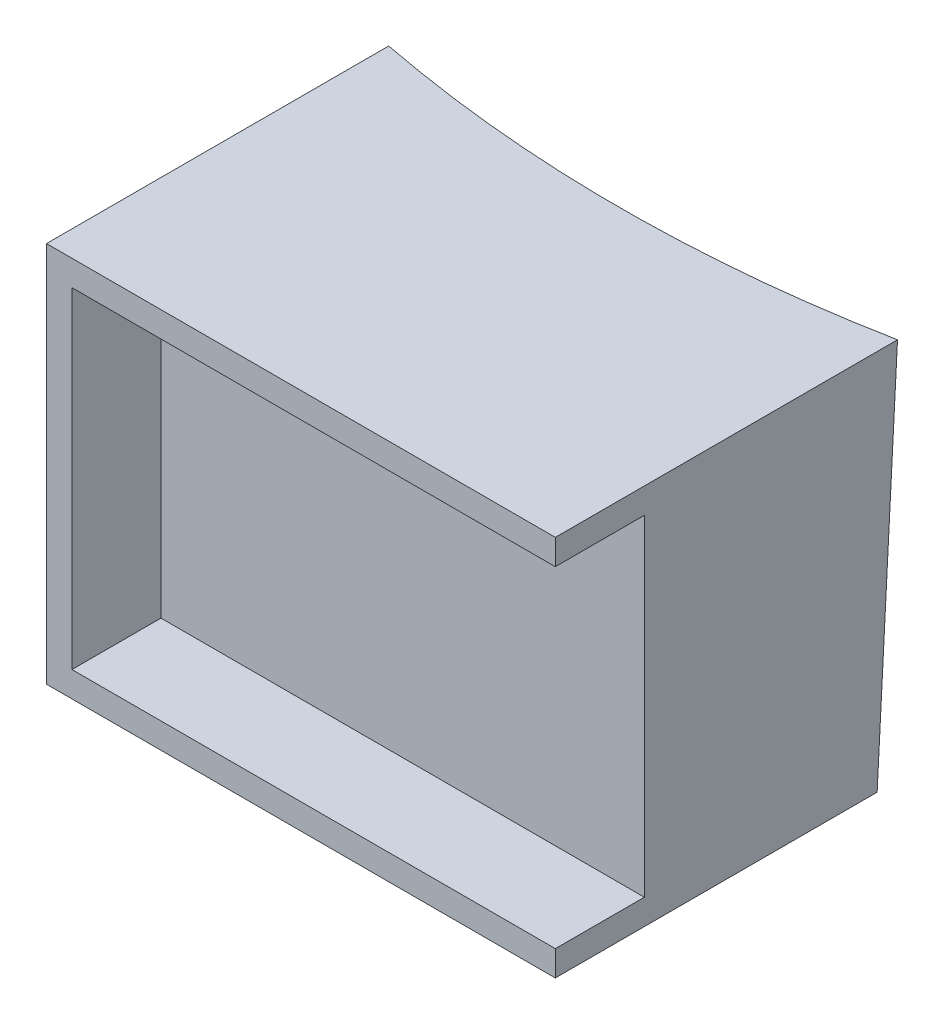
ISO-10303-21;
HEADER;
FILE_DESCRIPTION(('STEP AP214'),'2;1');
FILE_NAME('part.step','',(''),(''),'','','');
FILE_SCHEMA(('AUTOMOTIVE_DESIGN { 1 0 10303 214 1 1 1 1 }'));
ENDSEC;
DATA;
#1=APPLICATION_CONTEXT('core data for automotive mechanical design processes');
#2=APPLICATION_PROTOCOL_DEFINITION('international standard','automotive_design',2000,#1);
#3=PRODUCT_CONTEXT('',#1,'mechanical');
#4=PRODUCT('Part','Part','',(#3));
#5=PRODUCT_RELATED_PRODUCT_CATEGORY('part','',(#4));
#6=PRODUCT_DEFINITION_FORMATION('','',#4);
#7=PRODUCT_DEFINITION_CONTEXT('part definition',#1,'design');
#8=PRODUCT_DEFINITION('design','',#6,#7);
#9=PRODUCT_DEFINITION_SHAPE('','',#8);
#10=(LENGTH_UNIT() NAMED_UNIT(*) SI_UNIT(.MILLI.,.METRE.));
#11=(NAMED_UNIT(*) PLANE_ANGLE_UNIT() SI_UNIT($,.RADIAN.));
#12=(NAMED_UNIT(*) SI_UNIT($,.STERADIAN.) SOLID_ANGLE_UNIT());
#13=UNCERTAINTY_MEASURE_WITH_UNIT(LENGTH_MEASURE(1.E-05),#10,'distance_accuracy_value','');
#14=(GEOMETRIC_REPRESENTATION_CONTEXT(3) GLOBAL_UNCERTAINTY_ASSIGNED_CONTEXT((#13)) GLOBAL_UNIT_ASSIGNED_CONTEXT((#10,
#11,#12)) REPRESENTATION_CONTEXT('',''));
#15=CARTESIAN_POINT('',(0.,0.,0.));
#16=DIRECTION('',(0.,0.,1.));
#17=DIRECTION('',(1.,0.,0.));
#18=AXIS2_PLACEMENT_3D('',#15,#16,#17);
#19=CARTESIAN_POINT('',(0.,30.,130.));
#20=DIRECTION('',(1.,0.,0.));
#21=DIRECTION('',(0.,1.,0.));
#22=AXIS2_PLACEMENT_3D('',#19,#20,#21);
#23=PLANE('',#22);
#24=DIRECTION('',(0.,0.,-1.));
#25=VECTOR('',#24,1.);
#26=CARTESIAN_POINT('',(0.,30.,130.));
#27=LINE('',#26,#25);
#28=CARTESIAN_POINT('',(0.,30.,130.));
#29=VERTEX_POINT('',#28);
#30=CARTESIAN_POINT('',(0.,30.,103.100288572856));
#31=VERTEX_POINT('',#30);
#32=EDGE_CURVE('E255',#29,#31,#27,.T.);
#33=ORIENTED_EDGE('',*,*,#32,.T.);
#34=CARTESIAN_POINT('',(0.,149.336386161893,96.7219380971282));
#35=CARTESIAN_POINT('',(0.,118.095745378578,98.3938104110203));
#36=CARTESIAN_POINT('',(0.,86.8550115185211,100.063942753293));
#37=CARTESIAN_POINT('',(0.,24.3733808564521,103.401153471273));
#38=CARTESIAN_POINT('',(0.,-6.86751594555875,105.068231846998));
#39=CARTESIAN_POINT('',(0.,-51.6464413265629,107.455838469584));
#40=CARTESIAN_POINT('',(0.,-65.184413013588,108.177433956996));
#41=CARTESIAN_POINT('',(0.,-92.2603812844602,109.620158324614));
#42=CARTESIAN_POINT('',(0.,-105.798377868307,110.341287204819));
#43=CARTESIAN_POINT('',(0.,-119.336386161893,111.062196220779));
#44=B_SPLINE_CURVE_WITH_KNOTS('',3,(#34,#35,#36,#37,#38,#39,#40,#41,#42,#43),.UNSPECIFIED.,.F.,
.F.,(4,2,2,2,4),(0.,93.8560340268623,187.712067512617,228.383634934775,269.055202458257),.UNSPECIFIED.);
#45=CARTESIAN_POINT('',(0.,0.,104.701386539078));
#46=VERTEX_POINT('',#45);
#47=EDGE_CURVE('E70',#31,#46,#44,.T.);
#48=ORIENTED_EDGE('',*,*,#47,.T.);
#49=DIRECTION('',(0.,0.,-1.));
#50=VECTOR('',#49,1.);
#51=CARTESIAN_POINT('',(0.,0.,130.));
#52=LINE('',#51,#50);
#53=CARTESIAN_POINT('',(0.,0.,130.));
#54=VERTEX_POINT('',#53);
#55=EDGE_CURVE('E55',#54,#46,#52,.T.);
#56=ORIENTED_EDGE('',*,*,#55,.F.);
#57=DIRECTION('',(0.,-1.,0.));
#58=VECTOR('',#57,1.);
#59=CARTESIAN_POINT('',(0.,30.,130.));
#60=LINE('',#59,#58);
#61=EDGE_CURVE('E241',#29,#54,#60,.T.);
#62=ORIENTED_EDGE('',*,*,#61,.F.);
#63=EDGE_LOOP('',(#33,#48,#56,#62));
#64=FACE_BOUND('',#63,.T.);
#65=ADVANCED_FACE('F46',(#64),#23,.F.);
#66=CARTESIAN_POINT('',(0.,0.,130.));
#67=DIRECTION('',(0.,1.,0.));
#68=DIRECTION('',(0.,0.,1.));
#69=AXIS2_PLACEMENT_3D('',#66,#67,#68);
#70=PLANE('',#69);
#71=ORIENTED_EDGE('',*,*,#55,.T.);
#72=CARTESIAN_POINT('',(20.,0.,0.));
#73=DIRECTION('',(0.,1.,0.));
#74=DIRECTION('',(0.,0.,1.));
#75=AXIS2_PLACEMENT_3D('',#72,#73,#74);
#76=CIRCLE('',#75,106.594466756982);
#77=CARTESIAN_POINT('',(40.,0.,104.701386539078));
#78=VERTEX_POINT('',#77);
#79=EDGE_CURVE('E221',#46,#78,#76,.T.);
#80=ORIENTED_EDGE('',*,*,#79,.T.);
#81=DIRECTION('',(0.,0.,-1.));
#82=VECTOR('',#81,1.);
#83=CARTESIAN_POINT('',(40.,0.,130.));
#84=LINE('',#83,#82);
#85=CARTESIAN_POINT('',(40.,0.,130.));
#86=VERTEX_POINT('',#85);
#87=EDGE_CURVE('E263',#86,#78,#84,.T.);
#88=ORIENTED_EDGE('',*,*,#87,.F.);
#89=DIRECTION('',(1.,0.,0.));
#90=VECTOR('',#89,1.);
#91=CARTESIAN_POINT('',(0.,0.,130.));
#92=LINE('',#91,#90);
#93=EDGE_CURVE('E245',#54,#86,#92,.T.);
#94=ORIENTED_EDGE('',*,*,#93,.F.);
#95=EDGE_LOOP('',(#71,#80,#88,#94));
#96=FACE_BOUND('',#95,.T.);
#97=ADVANCED_FACE('F271',(#96),#70,.F.);
#98=CARTESIAN_POINT('',(40.,30.,130.));
#99=DIRECTION('',(-1.,0.,0.));
#100=DIRECTION('',(0.,-1.,0.));
#101=AXIS2_PLACEMENT_3D('',#98,#99,#100);
#102=PLANE('',#101);
#103=DIRECTION('',(0.,1.,0.));
#104=VECTOR('',#103,1.);
#105=CARTESIAN_POINT('',(40.,28.,123.));
#106=LINE('',#105,#104);
#107=CARTESIAN_POINT('',(40.,2.,123.));
#108=VERTEX_POINT('',#107);
#109=CARTESIAN_POINT('',(40.,28.,123.));
#110=VERTEX_POINT('',#109);
#111=EDGE_CURVE('E143',#108,#110,#106,.T.);
#112=ORIENTED_EDGE('',*,*,#111,.F.);
#113=DIRECTION('',(0.,0.,1.));
#114=VECTOR('',#113,1.);
#115=CARTESIAN_POINT('',(40.,2.,123.));
#116=LINE('',#115,#114);
#117=CARTESIAN_POINT('',(40.,2.,130.));
#118=VERTEX_POINT('',#117);
#119=EDGE_CURVE('E189',#108,#118,#116,.T.);
#120=ORIENTED_EDGE('',*,*,#119,.T.);
#121=DIRECTION('',(0.,1.,0.));
#122=VECTOR('',#121,1.);
#123=CARTESIAN_POINT('',(40.,30.,130.));
#124=LINE('',#123,#122);
#125=EDGE_CURVE('E248',#86,#118,#124,.T.);
#126=ORIENTED_EDGE('',*,*,#125,.F.);
#127=ORIENTED_EDGE('',*,*,#87,.T.);
#128=CARTESIAN_POINT('',(40.0000000000001,-119.336386161893,111.062196220779));
#129=CARTESIAN_POINT('',(40.,-83.6415244981906,109.161395021979));
#130=CARTESIAN_POINT('',(40.,-47.9467417971187,107.259109291979));
#131=CARTESIAN_POINT('',(40.,23.4426317442182,103.450946398833));
#132=CARTESIAN_POINT('',(40.,59.1372225844847,101.545069235715));
#133=CARTESIAN_POINT('',(40.,103.915830098653,99.1515093767218));
#134=CARTESIAN_POINT('',(40.,112.999952106178,98.6657971351198));
#135=CARTESIAN_POINT('',(39.9999999999999,131.168180808293,97.6940860182802));
#136=CARTESIAN_POINT('',(39.9999999999999,140.252287502881,97.2080871430421));
#137=CARTESIAN_POINT('',(39.9999999999999,149.336386161893,96.7219380971282));
#138=B_SPLINE_CURVE_WITH_KNOTS('',3,(#128,#129,#130,#131,#132,#133,#134,#135,#136,#137),
.UNSPECIFIED.,.F.,.F.,(4,2,2,2,4),(0.,107.236308098329,214.472615386214,241.763908888912,
269.055202443955),.UNSPECIFIED.);
#139=CARTESIAN_POINT('',(40.,30.,103.100288572856));
#140=VERTEX_POINT('',#139);
#141=EDGE_CURVE('E202',#78,#140,#138,.T.);
#142=ORIENTED_EDGE('',*,*,#141,.T.);
#143=DIRECTION('',(0.,0.,-1.));
#144=VECTOR('',#143,1.);
#145=CARTESIAN_POINT('',(40.,30.,130.));
#146=LINE('',#145,#144);
#147=CARTESIAN_POINT('',(40.,30.,130.));
#148=VERTEX_POINT('',#147);
#149=EDGE_CURVE('E259',#148,#140,#146,.T.);
#150=ORIENTED_EDGE('',*,*,#149,.F.);
#151=CARTESIAN_POINT('',(40.,28.,130.));
#152=VERTEX_POINT('',#151);
#153=EDGE_CURVE('E158',#152,#148,#124,.T.);
#154=ORIENTED_EDGE('',*,*,#153,.F.);
#155=DIRECTION('',(0.,0.,1.));
#156=VECTOR('',#155,1.);
#157=CARTESIAN_POINT('',(40.,28.,123.));
#158=LINE('',#157,#156);
#159=EDGE_CURVE('E62',#110,#152,#158,.T.);
#160=ORIENTED_EDGE('',*,*,#159,.F.);
#161=EDGE_LOOP('',(#112,#120,#126,#127,#142,#150,#154,#160));
#162=FACE_BOUND('',#161,.T.);
#163=ADVANCED_FACE('F156',(#162),#102,.F.);
#164=CARTESIAN_POINT('',(0.,30.,130.));
#165=DIRECTION('',(0.,-1.,0.));
#166=DIRECTION('',(0.,0.,-1.));
#167=AXIS2_PLACEMENT_3D('',#164,#165,#166);
#168=PLANE('',#167);
#169=ORIENTED_EDGE('',*,*,#149,.T.);
#170=CARTESIAN_POINT('',(20.,30.,0.));
#171=DIRECTION('',(0.,-1.,0.));
#172=DIRECTION('',(0.,0.,-1.));
#173=AXIS2_PLACEMENT_3D('',#170,#171,#172);
#174=CIRCLE('',#173,105.022233378491);
#175=EDGE_CURVE('E11',#140,#31,#174,.T.);
#176=ORIENTED_EDGE('',*,*,#175,.T.);
#177=ORIENTED_EDGE('',*,*,#32,.F.);
#178=DIRECTION('',(-1.,0.,0.));
#179=VECTOR('',#178,1.);
#180=CARTESIAN_POINT('',(0.,30.,130.));
#181=LINE('',#180,#179);
#182=EDGE_CURVE('E252',#148,#29,#181,.T.);
#183=ORIENTED_EDGE('',*,*,#182,.F.);
#184=EDGE_LOOP('',(#169,#176,#177,#183));
#185=FACE_BOUND('',#184,.T.);
#186=ADVANCED_FACE('F278',(#185),#168,.F.);
#187=CARTESIAN_POINT('',(0.,0.,130.));
#188=DIRECTION('',(0.,0.,1.));
#189=DIRECTION('',(1.,0.,0.));
#190=AXIS2_PLACEMENT_3D('',#187,#188,#189);
#191=PLANE('',#190);
#192=DIRECTION('',(1.,0.,0.));
#193=VECTOR('',#192,1.);
#194=CARTESIAN_POINT('',(40.,2.,130.));
#195=LINE('',#194,#193);
#196=CARTESIAN_POINT('',(2.,1.99999999999999,130.));
#197=VERTEX_POINT('',#196);
#198=EDGE_CURVE('E153',#197,#118,#195,.T.);
#199=ORIENTED_EDGE('',*,*,#198,.F.);
#200=DIRECTION('',(0.,-1.,0.));
#201=VECTOR('',#200,1.);
#202=CARTESIAN_POINT('',(2.,28.,130.));
#203=LINE('',#202,#201);
#204=CARTESIAN_POINT('',(2.,28.,130.));
#205=VERTEX_POINT('',#204);
#206=EDGE_CURVE('E294',#205,#197,#203,.T.);
#207=ORIENTED_EDGE('',*,*,#206,.F.);
#208=DIRECTION('',(-1.,0.,0.));
#209=VECTOR('',#208,1.);
#210=CARTESIAN_POINT('',(40.,28.,130.));
#211=LINE('',#210,#209);
#212=EDGE_CURVE('E283',#152,#205,#211,.T.);
#213=ORIENTED_EDGE('',*,*,#212,.F.);
#214=ORIENTED_EDGE('',*,*,#153,.T.);
#215=ORIENTED_EDGE('',*,*,#182,.T.);
#216=ORIENTED_EDGE('',*,*,#61,.T.);
#217=ORIENTED_EDGE('',*,*,#93,.T.);
#218=ORIENTED_EDGE('',*,*,#125,.T.);
#219=EDGE_LOOP('',(#199,#207,#213,#214,#215,#216,#217,#218));
#220=FACE_BOUND('',#219,.T.);
#221=ADVANCED_FACE('F231',(#220),#191,.T.);
#222=CARTESIAN_POINT('',(20.,60.,0.));
#223=DIRECTION('',(0.,-1.,0.));
#224=DIRECTION('',(1.,0.,0.));
#225=AXIS2_PLACEMENT_3D('',#222,#223,#224);
#226=CONICAL_SURFACE('',#225,103.45,0.0523598775598265);
#227=ORIENTED_EDGE('',*,*,#175,.F.);
#228=ORIENTED_EDGE('',*,*,#141,.F.);
#229=ORIENTED_EDGE('',*,*,#79,.F.);
#230=ORIENTED_EDGE('',*,*,#47,.F.);
#231=EDGE_LOOP('',(#227,#228,#229,#230));
#232=FACE_BOUND('',#231,.T.);
#233=ADVANCED_FACE('F225',(#232),#226,.F.);
#234=CARTESIAN_POINT('',(40.,2.,123.));
#235=DIRECTION('',(0.,-1.,0.));
#236=DIRECTION('',(1.,0.,0.));
#237=AXIS2_PLACEMENT_3D('',#234,#235,#236);
#238=PLANE('',#237);
#239=ORIENTED_EDGE('',*,*,#198,.T.);
#240=ORIENTED_EDGE('',*,*,#119,.F.);
#241=DIRECTION('',(1.,0.,0.));
#242=VECTOR('',#241,1.);
#243=CARTESIAN_POINT('',(40.,2.,123.));
#244=LINE('',#243,#242);
#245=CARTESIAN_POINT('',(2.,1.99999999999999,123.));
#246=VERTEX_POINT('',#245);
#247=EDGE_CURVE('E149',#246,#108,#244,.T.);
#248=ORIENTED_EDGE('',*,*,#247,.F.);
#249=DIRECTION('',(0.,0.,1.));
#250=VECTOR('',#249,1.);
#251=CARTESIAN_POINT('',(2.,1.99999999999999,123.));
#252=LINE('',#251,#250);
#253=EDGE_CURVE('E163',#246,#197,#252,.T.);
#254=ORIENTED_EDGE('',*,*,#253,.T.);
#255=EDGE_LOOP('',(#239,#240,#248,#254));
#256=FACE_BOUND('',#255,.T.);
#257=ADVANCED_FACE('F230',(#256),#238,.F.);
#258=CARTESIAN_POINT('',(2.,28.,123.));
#259=DIRECTION('',(-1.,0.,0.));
#260=DIRECTION('',(0.,-1.,0.));
#261=AXIS2_PLACEMENT_3D('',#258,#259,#260);
#262=PLANE('',#261);
#263=ORIENTED_EDGE('',*,*,#206,.T.);
#264=ORIENTED_EDGE('',*,*,#253,.F.);
#265=DIRECTION('',(0.,-1.,0.));
#266=VECTOR('',#265,1.);
#267=CARTESIAN_POINT('',(2.,28.,123.));
#268=LINE('',#267,#266);
#269=CARTESIAN_POINT('',(2.,28.,123.));
#270=VERTEX_POINT('',#269);
#271=EDGE_CURVE('E142',#270,#246,#268,.T.);
#272=ORIENTED_EDGE('',*,*,#271,.F.);
#273=DIRECTION('',(0.,0.,1.));
#274=VECTOR('',#273,1.);
#275=CARTESIAN_POINT('',(2.,28.,123.));
#276=LINE('',#275,#274);
#277=EDGE_CURVE('E137',#270,#205,#276,.T.);
#278=ORIENTED_EDGE('',*,*,#277,.T.);
#279=EDGE_LOOP('',(#263,#264,#272,#278));
#280=FACE_BOUND('',#279,.T.);
#281=ADVANCED_FACE('F302',(#280),#262,.F.);
#282=CARTESIAN_POINT('',(40.,28.,123.));
#283=DIRECTION('',(0.,1.,0.));
#284=DIRECTION('',(-1.,0.,0.));
#285=AXIS2_PLACEMENT_3D('',#282,#283,#284);
#286=PLANE('',#285);
#287=ORIENTED_EDGE('',*,*,#212,.T.);
#288=ORIENTED_EDGE('',*,*,#277,.F.);
#289=DIRECTION('',(-1.,0.,0.));
#290=VECTOR('',#289,1.);
#291=CARTESIAN_POINT('',(40.,28.,123.));
#292=LINE('',#291,#290);
#293=EDGE_CURVE('E134',#110,#270,#292,.T.);
#294=ORIENTED_EDGE('',*,*,#293,.F.);
#295=ORIENTED_EDGE('',*,*,#159,.T.);
#296=EDGE_LOOP('',(#287,#288,#294,#295));
#297=FACE_BOUND('',#296,.T.);
#298=ADVANCED_FACE('F136',(#297),#286,.F.);
#299=CARTESIAN_POINT('',(0.,0.,123.));
#300=DIRECTION('',(0.,0.,-1.));
#301=DIRECTION('',(-1.,0.,0.));
#302=AXIS2_PLACEMENT_3D('',#299,#300,#301);
#303=PLANE('',#302);
#304=ORIENTED_EDGE('',*,*,#111,.T.);
#305=ORIENTED_EDGE('',*,*,#293,.T.);
#306=ORIENTED_EDGE('',*,*,#271,.T.);
#307=ORIENTED_EDGE('',*,*,#247,.T.);
#308=EDGE_LOOP('',(#304,#305,#306,#307));
#309=FACE_BOUND('',#308,.T.);
#310=ADVANCED_FACE('F147',(#309),#303,.F.);
#311=CLOSED_SHELL('',(#65,#97,#163,#186,#221,#233,#257,#281,#298,#310));
#312=CARTESIAN_POINT('',(5.,5.,110.));
#313=DIRECTION('',(0.,-1.,0.));
#314=DIRECTION('',(0.,0.,-1.));
#315=AXIS2_PLACEMENT_3D('',#312,#313,#314);
#316=PLANE('',#315);
#317=DIRECTION('',(1.,0.,0.));
#318=VECTOR('',#317,1.);
#319=CARTESIAN_POINT('',(5.,5.,120.));
#320=LINE('',#319,#318);
#321=CARTESIAN_POINT('',(5.,5.,120.));
#322=VERTEX_POINT('',#321);
#323=CARTESIAN_POINT('',(35.,5.,120.));
#324=VERTEX_POINT('',#323);
#325=EDGE_CURVE('E184',#322,#324,#320,.T.);
#326=ORIENTED_EDGE('',*,*,#325,.T.);
#327=DIRECTION('',(0.,0.,1.));
#328=VECTOR('',#327,1.);
#329=CARTESIAN_POINT('',(35.,5.,110.));
#330=LINE('',#329,#328);
#331=CARTESIAN_POINT('',(35.,5.,110.));
#332=VERTEX_POINT('',#331);
#333=EDGE_CURVE('E183',#332,#324,#330,.T.);
#334=ORIENTED_EDGE('',*,*,#333,.F.);
#335=DIRECTION('',(1.,0.,0.));
#336=VECTOR('',#335,1.);
#337=CARTESIAN_POINT('',(5.,5.,110.));
#338=LINE('',#337,#336);
#339=CARTESIAN_POINT('',(5.,5.,110.));
#340=VERTEX_POINT('',#339);
#341=EDGE_CURVE('E168',#340,#332,#338,.T.);
#342=ORIENTED_EDGE('',*,*,#341,.F.);
#343=DIRECTION('',(0.,0.,1.));
#344=VECTOR('',#343,1.);
#345=CARTESIAN_POINT('',(5.,5.,110.));
#346=LINE('',#345,#344);
#347=EDGE_CURVE('E199',#340,#322,#346,.T.);
#348=ORIENTED_EDGE('',*,*,#347,.T.);
#349=EDGE_LOOP('',(#326,#334,#342,#348));
#350=FACE_BOUND('',#349,.T.);
#351=ADVANCED_FACE('F232',(#350),#316,.F.);
#352=CARTESIAN_POINT('',(5.,25.,110.));
#353=DIRECTION('',(-1.,0.,0.));
#354=DIRECTION('',(0.,-1.,0.));
#355=AXIS2_PLACEMENT_3D('',#352,#353,#354);
#356=PLANE('',#355);
#357=DIRECTION('',(0.,-1.,0.));
#358=VECTOR('',#357,1.);
#359=CARTESIAN_POINT('',(5.,25.,120.));
#360=LINE('',#359,#358);
#361=CARTESIAN_POINT('',(5.,25.,120.));
#362=VERTEX_POINT('',#361);
#363=EDGE_CURVE('E173',#362,#322,#360,.T.);
#364=ORIENTED_EDGE('',*,*,#363,.T.);
#365=ORIENTED_EDGE('',*,*,#347,.F.);
#366=DIRECTION('',(0.,-1.,0.));
#367=VECTOR('',#366,1.);
#368=CARTESIAN_POINT('',(5.,25.,110.));
#369=LINE('',#368,#367);
#370=CARTESIAN_POINT('',(5.,25.,110.));
#371=VERTEX_POINT('',#370);
#372=EDGE_CURVE('E179',#371,#340,#369,.T.);
#373=ORIENTED_EDGE('',*,*,#372,.F.);
#374=DIRECTION('',(0.,0.,1.));
#375=VECTOR('',#374,1.);
#376=CARTESIAN_POINT('',(5.,25.,110.));
#377=LINE('',#376,#375);
#378=EDGE_CURVE('E203',#371,#362,#377,.T.);
#379=ORIENTED_EDGE('',*,*,#378,.T.);
#380=EDGE_LOOP('',(#364,#365,#373,#379));
#381=FACE_BOUND('',#380,.T.);
#382=ADVANCED_FACE('F344',(#381),#356,.F.);
#383=CARTESIAN_POINT('',(5.,25.,110.));
#384=DIRECTION('',(0.,-1.,0.));
#385=DIRECTION('',(0.,0.,-1.));
#386=AXIS2_PLACEMENT_3D('',#383,#384,#385);
#387=PLANE('',#386);
#388=DIRECTION('',(1.,0.,0.));
#389=VECTOR('',#388,1.);
#390=CARTESIAN_POINT('',(5.,25.,120.));
#391=LINE('',#390,#389);
#392=CARTESIAN_POINT('',(35.,25.,120.));
#393=VERTEX_POINT('',#392);
#394=EDGE_CURVE('E193',#362,#393,#391,.T.);
#395=ORIENTED_EDGE('',*,*,#394,.F.);
#396=ORIENTED_EDGE('',*,*,#378,.F.);
#397=DIRECTION('',(1.,0.,0.));
#398=VECTOR('',#397,1.);
#399=CARTESIAN_POINT('',(5.,25.,110.));
#400=LINE('',#399,#398);
#401=CARTESIAN_POINT('',(35.,25.,110.));
#402=VERTEX_POINT('',#401);
#403=EDGE_CURVE('E176',#371,#402,#400,.T.);
#404=ORIENTED_EDGE('',*,*,#403,.T.);
#405=DIRECTION('',(0.,0.,1.));
#406=VECTOR('',#405,1.);
#407=CARTESIAN_POINT('',(35.,25.,110.));
#408=LINE('',#407,#406);
#409=EDGE_CURVE('E206',#402,#393,#408,.T.);
#410=ORIENTED_EDGE('',*,*,#409,.T.);
#411=EDGE_LOOP('',(#395,#396,#404,#410));
#412=FACE_BOUND('',#411,.T.);
#413=ADVANCED_FACE('F354',(#412),#387,.T.);
#414=CARTESIAN_POINT('',(35.,25.,110.));
#415=DIRECTION('',(-1.,0.,0.));
#416=DIRECTION('',(0.,-1.,0.));
#417=AXIS2_PLACEMENT_3D('',#414,#415,#416);
#418=PLANE('',#417);
#419=DIRECTION('',(0.,-1.,0.));
#420=VECTOR('',#419,1.);
#421=CARTESIAN_POINT('',(35.,25.,120.));
#422=LINE('',#421,#420);
#423=EDGE_CURVE('E188',#393,#324,#422,.T.);
#424=ORIENTED_EDGE('',*,*,#423,.F.);
#425=ORIENTED_EDGE('',*,*,#409,.F.);
#426=DIRECTION('',(0.,-1.,0.));
#427=VECTOR('',#426,1.);
#428=CARTESIAN_POINT('',(35.,25.,110.));
#429=LINE('',#428,#427);
#430=EDGE_CURVE('E172',#402,#332,#429,.T.);
#431=ORIENTED_EDGE('',*,*,#430,.T.);
#432=ORIENTED_EDGE('',*,*,#333,.T.);
#433=EDGE_LOOP('',(#424,#425,#431,#432));
#434=FACE_BOUND('',#433,.T.);
#435=ADVANCED_FACE('F364',(#434),#418,.T.);
#436=CARTESIAN_POINT('',(0.,0.,110.));
#437=DIRECTION('',(0.,0.,-1.));
#438=DIRECTION('',(-1.,0.,0.));
#439=AXIS2_PLACEMENT_3D('',#436,#437,#438);
#440=PLANE('',#439);
#441=ORIENTED_EDGE('',*,*,#341,.T.);
#442=ORIENTED_EDGE('',*,*,#430,.F.);
#443=ORIENTED_EDGE('',*,*,#403,.F.);
#444=ORIENTED_EDGE('',*,*,#372,.T.);
#445=EDGE_LOOP('',(#441,#442,#443,#444));
#446=FACE_BOUND('',#445,.T.);
#447=ADVANCED_FACE('F374',(#446),#440,.F.);
#448=CARTESIAN_POINT('',(0.,0.,120.));
#449=DIRECTION('',(0.,0.,-1.));
#450=DIRECTION('',(-1.,0.,0.));
#451=AXIS2_PLACEMENT_3D('',#448,#449,#450);
#452=PLANE('',#451);
#453=ORIENTED_EDGE('',*,*,#325,.F.);
#454=ORIENTED_EDGE('',*,*,#363,.F.);
#455=ORIENTED_EDGE('',*,*,#394,.T.);
#456=ORIENTED_EDGE('',*,*,#423,.T.);
#457=EDGE_LOOP('',(#453,#454,#455,#456));
#458=FACE_BOUND('',#457,.T.);
#459=ADVANCED_FACE('F383',(#458),#452,.T.);
#460=CLOSED_SHELL('',(#351,#382,#413,#435,#447,#459));
#461=ORIENTED_CLOSED_SHELL('',*,#460,.T.);
#462=BREP_WITH_VOIDS('B2',#311,(#461));
#463=ADVANCED_BREP_SHAPE_REPRESENTATION('',(#18,#462),#14);
#464=SHAPE_DEFINITION_REPRESENTATION(#9,#463);
ENDSEC;
END-ISO-10303-21;
